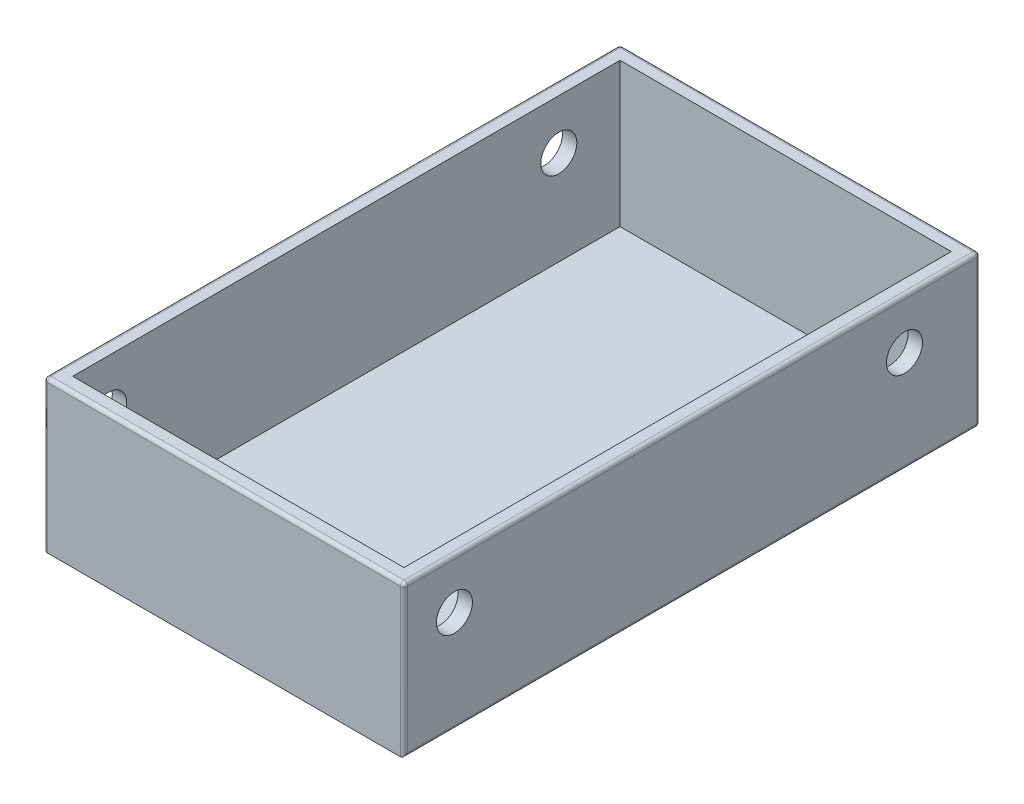
ISO-10303-21;
HEADER;
FILE_DESCRIPTION(('STEP AP214'),'2;1');
FILE_NAME('part.step','',(''),(''),'','','');
FILE_SCHEMA(('AUTOMOTIVE_DESIGN { 1 0 10303 214 1 1 1 1 }'));
ENDSEC;
DATA;
#1=APPLICATION_CONTEXT('core data for automotive mechanical design processes');
#2=APPLICATION_PROTOCOL_DEFINITION('international standard','automotive_design',2000,#1);
#3=PRODUCT_CONTEXT('',#1,'mechanical');
#4=PRODUCT('Part','Part','',(#3));
#5=PRODUCT_RELATED_PRODUCT_CATEGORY('part','',(#4));
#6=PRODUCT_DEFINITION_FORMATION('','',#4);
#7=PRODUCT_DEFINITION_CONTEXT('part definition',#1,'design');
#8=PRODUCT_DEFINITION('design','',#6,#7);
#9=PRODUCT_DEFINITION_SHAPE('','',#8);
#10=(LENGTH_UNIT() NAMED_UNIT(*) SI_UNIT(.MILLI.,.METRE.));
#11=(NAMED_UNIT(*) PLANE_ANGLE_UNIT() SI_UNIT($,.RADIAN.));
#12=(NAMED_UNIT(*) SI_UNIT($,.STERADIAN.) SOLID_ANGLE_UNIT());
#13=UNCERTAINTY_MEASURE_WITH_UNIT(LENGTH_MEASURE(1.E-05),#10,'distance_accuracy_value','');
#14=(GEOMETRIC_REPRESENTATION_CONTEXT(3) GLOBAL_UNCERTAINTY_ASSIGNED_CONTEXT((#13)) GLOBAL_UNIT_ASSIGNED_CONTEXT((#10,
#11,#12)) REPRESENTATION_CONTEXT('',''));
#15=CARTESIAN_POINT('',(0.,0.,0.));
#16=DIRECTION('',(0.,0.,1.));
#17=DIRECTION('',(1.,0.,0.));
#18=AXIS2_PLACEMENT_3D('',#15,#16,#17);
#19=CARTESIAN_POINT('',(0.,-5.,0.));
#20=DIRECTION('',(-1.,0.,0.));
#21=DIRECTION('',(0.,0.,1.));
#22=AXIS2_PLACEMENT_3D('',#19,#20,#21);
#23=PLANE('',#22);
#24=DIRECTION('',(0.,1.,0.));
#25=VECTOR('',#24,1.);
#26=CARTESIAN_POINT('',(0.,-5.,-79.5));
#27=LINE('',#26,#25);
#28=CARTESIAN_POINT('',(0.,14.5,-79.5));
#29=VERTEX_POINT('',#28);
#30=CARTESIAN_POINT('',(0.,-5.5,-79.5));
#31=VERTEX_POINT('',#30);
#32=EDGE_CURVE('E227',#29,#31,#27,.F.);
#33=ORIENTED_EDGE('',*,*,#32,.T.);
#34=DIRECTION('',(0.,0.,-1.));
#35=VECTOR('',#34,1.);
#36=CARTESIAN_POINT('',(0.,-5.5,0.));
#37=LINE('',#36,#35);
#38=CARTESIAN_POINT('',(0.,-5.5,-0.5));
#39=VERTEX_POINT('',#38);
#40=EDGE_CURVE('E232',#31,#39,#37,.F.);
#41=ORIENTED_EDGE('',*,*,#40,.T.);
#42=DIRECTION('',(0.,1.,0.));
#43=VECTOR('',#42,1.);
#44=CARTESIAN_POINT('',(0.,-5.,-0.5));
#45=LINE('',#44,#43);
#46=CARTESIAN_POINT('',(0.,14.5,-0.5));
#47=VERTEX_POINT('',#46);
#48=EDGE_CURVE('E229',#39,#47,#45,.T.);
#49=ORIENTED_EDGE('',*,*,#48,.T.);
#50=DIRECTION('',(0.,0.,1.));
#51=VECTOR('',#50,1.);
#52=CARTESIAN_POINT('',(0.,14.5,-80.));
#53=LINE('',#52,#51);
#54=EDGE_CURVE('E225',#47,#29,#53,.F.);
#55=ORIENTED_EDGE('',*,*,#54,.T.);
#56=EDGE_LOOP('',(#33,#41,#49,#55));
#57=FACE_BOUND('',#56,.T.);
#58=CARTESIAN_POINT('',(0.,8.1,-69.5));
#59=DIRECTION('',(-1.,0.,0.));
#60=DIRECTION('',(0.,0.,1.));
#61=AXIS2_PLACEMENT_3D('',#58,#59,#60);
#62=CIRCLE('',#61,2.5);
#63=CARTESIAN_POINT('',(0.,8.1,-67.));
#64=VERTEX_POINT('',#63);
#65=EDGE_CURVE('E174',#64,#64,#62,.T.);
#66=ORIENTED_EDGE('',*,*,#65,.F.);
#67=EDGE_LOOP('',(#66));
#68=FACE_BOUND('',#67,.T.);
#69=CARTESIAN_POINT('',(0.,8.1,-6.99999999999999));
#70=DIRECTION('',(-1.,0.,0.));
#71=DIRECTION('',(0.,0.,1.));
#72=AXIS2_PLACEMENT_3D('',#69,#70,#71);
#73=CIRCLE('',#72,2.5);
#74=CARTESIAN_POINT('',(0.,8.1,-4.49999999999999));
#75=VERTEX_POINT('',#74);
#76=EDGE_CURVE('E209',#75,#75,#73,.T.);
#77=ORIENTED_EDGE('',*,*,#76,.F.);
#78=EDGE_LOOP('',(#77));
#79=FACE_BOUND('',#78,.T.);
#80=ADVANCED_FACE('F35',(#57,#68,#79),#23,.T.);
#81=CARTESIAN_POINT('',(0.,-5.,-80.));
#82=DIRECTION('',(0.,0.,-1.));
#83=DIRECTION('',(-1.,0.,0.));
#84=AXIS2_PLACEMENT_3D('',#81,#82,#83);
#85=PLANE('',#84);
#86=DIRECTION('',(0.,1.,0.));
#87=VECTOR('',#86,1.);
#88=CARTESIAN_POINT('',(49.5,-5.,-80.));
#89=LINE('',#88,#87);
#90=CARTESIAN_POINT('',(49.5,14.5,-80.));
#91=VERTEX_POINT('',#90);
#92=CARTESIAN_POINT('',(49.5,-5.5,-80.));
#93=VERTEX_POINT('',#92);
#94=EDGE_CURVE('E236',#91,#93,#89,.F.);
#95=ORIENTED_EDGE('',*,*,#94,.T.);
#96=DIRECTION('',(1.,0.,0.));
#97=VECTOR('',#96,1.);
#98=CARTESIAN_POINT('',(0.,-5.5,-80.));
#99=LINE('',#98,#97);
#100=CARTESIAN_POINT('',(0.499999999999993,-5.5,-80.));
#101=VERTEX_POINT('',#100);
#102=EDGE_CURVE('E241',#93,#101,#99,.F.);
#103=ORIENTED_EDGE('',*,*,#102,.T.);
#104=DIRECTION('',(0.,1.,0.));
#105=VECTOR('',#104,1.);
#106=CARTESIAN_POINT('',(0.499999999999993,-5.,-80.));
#107=LINE('',#106,#105);
#108=CARTESIAN_POINT('',(0.499999999999993,14.5,-80.));
#109=VERTEX_POINT('',#108);
#110=EDGE_CURVE('E238',#101,#109,#107,.T.);
#111=ORIENTED_EDGE('',*,*,#110,.T.);
#112=DIRECTION('',(-1.,0.,0.));
#113=VECTOR('',#112,1.);
#114=CARTESIAN_POINT('',(50.,14.5,-80.));
#115=LINE('',#114,#113);
#116=EDGE_CURVE('E234',#109,#91,#115,.F.);
#117=ORIENTED_EDGE('',*,*,#116,.T.);
#118=EDGE_LOOP('',(#95,#103,#111,#117));
#119=FACE_BOUND('',#118,.T.);
#120=ADVANCED_FACE('F339',(#119),#85,.T.);
#121=CARTESIAN_POINT('',(50.,-5.,0.));
#122=DIRECTION('',(1.,0.,0.));
#123=DIRECTION('',(0.,0.,-1.));
#124=AXIS2_PLACEMENT_3D('',#121,#122,#123);
#125=PLANE('',#124);
#126=DIRECTION('',(0.,1.,0.));
#127=VECTOR('',#126,1.);
#128=CARTESIAN_POINT('',(50.,-5.,-0.5));
#129=LINE('',#128,#127);
#130=CARTESIAN_POINT('',(50.,14.5,-0.5));
#131=VERTEX_POINT('',#130);
#132=CARTESIAN_POINT('',(50.,-5.5,-0.5));
#133=VERTEX_POINT('',#132);
#134=EDGE_CURVE('E220',#131,#133,#129,.F.);
#135=ORIENTED_EDGE('',*,*,#134,.T.);
#136=DIRECTION('',(0.,0.,-1.));
#137=VECTOR('',#136,1.);
#138=CARTESIAN_POINT('',(50.,-5.5,-80.));
#139=LINE('',#138,#137);
#140=CARTESIAN_POINT('',(50.,-5.5,-79.5));
#141=VERTEX_POINT('',#140);
#142=EDGE_CURVE('E223',#133,#141,#139,.T.);
#143=ORIENTED_EDGE('',*,*,#142,.T.);
#144=DIRECTION('',(0.,1.,0.));
#145=VECTOR('',#144,1.);
#146=CARTESIAN_POINT('',(50.,-5.,-79.5));
#147=LINE('',#146,#145);
#148=CARTESIAN_POINT('',(50.,14.5,-79.5));
#149=VERTEX_POINT('',#148);
#150=EDGE_CURVE('E218',#141,#149,#147,.T.);
#151=ORIENTED_EDGE('',*,*,#150,.T.);
#152=DIRECTION('',(0.,0.,-1.));
#153=VECTOR('',#152,1.);
#154=CARTESIAN_POINT('',(50.,14.5,0.));
#155=LINE('',#154,#153);
#156=EDGE_CURVE('E216',#149,#131,#155,.F.);
#157=ORIENTED_EDGE('',*,*,#156,.T.);
#158=EDGE_LOOP('',(#135,#143,#151,#157));
#159=FACE_BOUND('',#158,.T.);
#160=CARTESIAN_POINT('',(50.,8.1,-69.5));
#161=DIRECTION('',(1.,0.,0.));
#162=DIRECTION('',(0.,0.,-1.));
#163=AXIS2_PLACEMENT_3D('',#160,#161,#162);
#164=CIRCLE('',#163,2.5);
#165=CARTESIAN_POINT('',(50.,8.1,-72.));
#166=VERTEX_POINT('',#165);
#167=EDGE_CURVE('E204',#166,#166,#164,.T.);
#168=ORIENTED_EDGE('',*,*,#167,.F.);
#169=EDGE_LOOP('',(#168));
#170=FACE_BOUND('',#169,.T.);
#171=CARTESIAN_POINT('',(50.,8.1,-7.));
#172=DIRECTION('',(1.,0.,0.));
#173=DIRECTION('',(0.,0.,-1.));
#174=AXIS2_PLACEMENT_3D('',#171,#172,#173);
#175=CIRCLE('',#174,2.5);
#176=CARTESIAN_POINT('',(50.,8.1,-9.5));
#177=VERTEX_POINT('',#176);
#178=EDGE_CURVE('E314',#177,#177,#175,.T.);
#179=ORIENTED_EDGE('',*,*,#178,.F.);
#180=EDGE_LOOP('',(#179));
#181=FACE_BOUND('',#180,.T.);
#182=ADVANCED_FACE('F366',(#159,#170,#181),#125,.T.);
#183=CARTESIAN_POINT('',(0.,-5.,0.));
#184=DIRECTION('',(0.,0.,1.));
#185=DIRECTION('',(1.,0.,0.));
#186=AXIS2_PLACEMENT_3D('',#183,#184,#185);
#187=PLANE('',#186);
#188=DIRECTION('',(1.,0.,0.));
#189=VECTOR('',#188,1.);
#190=CARTESIAN_POINT('',(0.,-6.,0.));
#191=LINE('',#190,#189);
#192=CARTESIAN_POINT('',(0.5,-6.,0.));
#193=VERTEX_POINT('',#192);
#194=CARTESIAN_POINT('',(49.5,-6.,0.));
#195=VERTEX_POINT('',#194);
#196=EDGE_CURVE('E192',#193,#195,#191,.T.);
#197=ORIENTED_EDGE('',*,*,#196,.T.);
#198=DIRECTION('',(0.,1.,0.));
#199=VECTOR('',#198,1.);
#200=CARTESIAN_POINT('',(49.5,-5.,0.));
#201=LINE('',#200,#199);
#202=CARTESIAN_POINT('',(49.5,14.5,0.));
#203=VERTEX_POINT('',#202);
#204=EDGE_CURVE('E213',#195,#203,#201,.T.);
#205=ORIENTED_EDGE('',*,*,#204,.T.);
#206=DIRECTION('',(1.,0.,0.));
#207=VECTOR('',#206,1.);
#208=CARTESIAN_POINT('',(0.,14.5,0.));
#209=LINE('',#208,#207);
#210=CARTESIAN_POINT('',(0.5,14.5,0.));
#211=VERTEX_POINT('',#210);
#212=EDGE_CURVE('E163',#203,#211,#209,.F.);
#213=ORIENTED_EDGE('',*,*,#212,.T.);
#214=DIRECTION('',(0.,1.,0.));
#215=VECTOR('',#214,1.);
#216=CARTESIAN_POINT('',(0.5,-5.,0.));
#217=LINE('',#216,#215);
#218=EDGE_CURVE('E211',#211,#193,#217,.F.);
#219=ORIENTED_EDGE('',*,*,#218,.T.);
#220=EDGE_LOOP('',(#197,#205,#213,#219));
#221=FACE_BOUND('',#220,.T.);
#222=ADVANCED_FACE('F370',(#221),#187,.T.);
#223=CARTESIAN_POINT('',(0.,-6.,0.));
#224=DIRECTION('',(0.,1.,0.));
#225=DIRECTION('',(0.,0.,1.));
#226=AXIS2_PLACEMENT_3D('',#223,#224,#225);
#227=PLANE('',#226);
#228=ORIENTED_EDGE('',*,*,#196,.F.);
#229=DIRECTION('',(0.,0.,-1.));
#230=VECTOR('',#229,1.);
#231=CARTESIAN_POINT('',(0.499999999999993,-6.,-80.));
#232=LINE('',#231,#230);
#233=CARTESIAN_POINT('',(0.499999999999993,-6.,-79.5));
#234=VERTEX_POINT('',#233);
#235=EDGE_CURVE('E255',#193,#234,#232,.T.);
#236=ORIENTED_EDGE('',*,*,#235,.T.);
#237=DIRECTION('',(1.,0.,0.));
#238=VECTOR('',#237,1.);
#239=CARTESIAN_POINT('',(50.,-6.,-79.5));
#240=LINE('',#239,#238);
#241=CARTESIAN_POINT('',(49.5,-6.,-79.5));
#242=VERTEX_POINT('',#241);
#243=EDGE_CURVE('E251',#234,#242,#240,.T.);
#244=ORIENTED_EDGE('',*,*,#243,.T.);
#245=DIRECTION('',(0.,0.,-1.));
#246=VECTOR('',#245,1.);
#247=CARTESIAN_POINT('',(49.5,-6.,0.));
#248=LINE('',#247,#246);
#249=EDGE_CURVE('E253',#242,#195,#248,.F.);
#250=ORIENTED_EDGE('',*,*,#249,.T.);
#251=EDGE_LOOP('',(#228,#236,#244,#250));
#252=FACE_BOUND('',#251,.T.);
#253=ADVANCED_FACE('F373',(#252),#227,.F.);
#254=CARTESIAN_POINT('',(0.,15.,0.));
#255=DIRECTION('',(0.,-1.,0.));
#256=DIRECTION('',(0.,0.,-1.));
#257=AXIS2_PLACEMENT_3D('',#254,#255,#256);
#258=PLANE('',#257);
#259=DIRECTION('',(0.,0.,1.));
#260=VECTOR('',#259,1.);
#261=CARTESIAN_POINT('',(0.5,15.,0.));
#262=LINE('',#261,#260);
#263=CARTESIAN_POINT('',(0.499999999999993,15.,-79.5));
#264=VERTEX_POINT('',#263);
#265=CARTESIAN_POINT('',(0.5,15.,-0.5));
#266=VERTEX_POINT('',#265);
#267=EDGE_CURVE('E59',#264,#266,#262,.T.);
#268=ORIENTED_EDGE('',*,*,#267,.T.);
#269=DIRECTION('',(1.,0.,0.));
#270=VECTOR('',#269,1.);
#271=CARTESIAN_POINT('',(50.,15.,-0.5));
#272=LINE('',#271,#270);
#273=CARTESIAN_POINT('',(49.5,15.,-0.5));
#274=VERTEX_POINT('',#273);
#275=EDGE_CURVE('E11',#266,#274,#272,.T.);
#276=ORIENTED_EDGE('',*,*,#275,.T.);
#277=DIRECTION('',(0.,0.,-1.));
#278=VECTOR('',#277,1.);
#279=CARTESIAN_POINT('',(49.5,15.,-80.));
#280=LINE('',#279,#278);
#281=CARTESIAN_POINT('',(49.5,15.,-79.5));
#282=VERTEX_POINT('',#281);
#283=EDGE_CURVE('E44',#274,#282,#280,.T.);
#284=ORIENTED_EDGE('',*,*,#283,.T.);
#285=DIRECTION('',(-1.,0.,0.));
#286=VECTOR('',#285,1.);
#287=CARTESIAN_POINT('',(0.,15.,-79.5));
#288=LINE('',#287,#286);
#289=EDGE_CURVE('E257',#282,#264,#288,.T.);
#290=ORIENTED_EDGE('',*,*,#289,.T.);
#291=EDGE_LOOP('',(#268,#276,#284,#290));
#292=FACE_BOUND('',#291,.T.);
#293=DIRECTION('',(0.,0.,1.));
#294=VECTOR('',#293,1.);
#295=CARTESIAN_POINT('',(2.,15.,-2.));
#296=LINE('',#295,#294);
#297=CARTESIAN_POINT('',(2.,15.,-78.));
#298=VERTEX_POINT('',#297);
#299=CARTESIAN_POINT('',(2.,15.,-2.));
#300=VERTEX_POINT('',#299);
#301=EDGE_CURVE('E167',#298,#300,#296,.T.);
#302=ORIENTED_EDGE('',*,*,#301,.F.);
#303=DIRECTION('',(-1.,0.,0.));
#304=VECTOR('',#303,1.);
#305=CARTESIAN_POINT('',(2.,15.,-78.));
#306=LINE('',#305,#304);
#307=CARTESIAN_POINT('',(48.,15.,-78.));
#308=VERTEX_POINT('',#307);
#309=EDGE_CURVE('E180',#308,#298,#306,.T.);
#310=ORIENTED_EDGE('',*,*,#309,.F.);
#311=DIRECTION('',(0.,0.,-1.));
#312=VECTOR('',#311,1.);
#313=CARTESIAN_POINT('',(48.,15.,-2.));
#314=LINE('',#313,#312);
#315=CARTESIAN_POINT('',(48.,15.,-2.));
#316=VERTEX_POINT('',#315);
#317=EDGE_CURVE('E178',#316,#308,#314,.T.);
#318=ORIENTED_EDGE('',*,*,#317,.F.);
#319=DIRECTION('',(1.,0.,0.));
#320=VECTOR('',#319,1.);
#321=CARTESIAN_POINT('',(2.,15.,-2.));
#322=LINE('',#321,#320);
#323=EDGE_CURVE('E157',#300,#316,#322,.T.);
#324=ORIENTED_EDGE('',*,*,#323,.F.);
#325=EDGE_LOOP('',(#302,#310,#318,#324));
#326=FACE_BOUND('',#325,.T.);
#327=ADVANCED_FACE('F176',(#292,#326),#258,.F.);
#328=CARTESIAN_POINT('',(0.,-5.,0.));
#329=DIRECTION('',(0.,1.,0.));
#330=DIRECTION('',(0.,0.,1.));
#331=AXIS2_PLACEMENT_3D('',#328,#329,#330);
#332=PLANE('',#331);
#333=DIRECTION('',(0.,0.,-1.));
#334=VECTOR('',#333,1.);
#335=CARTESIAN_POINT('',(2.,-5.,0.));
#336=LINE('',#335,#334);
#337=CARTESIAN_POINT('',(2.,-5.,-2.5));
#338=VERTEX_POINT('',#337);
#339=CARTESIAN_POINT('',(2.,-5.,-78.));
#340=VERTEX_POINT('',#339);
#341=EDGE_CURVE('E190',#338,#340,#336,.T.);
#342=ORIENTED_EDGE('',*,*,#341,.F.);
#343=DIRECTION('',(1.,0.,0.));
#344=VECTOR('',#343,1.);
#345=CARTESIAN_POINT('',(48.,-5.,-2.5));
#346=LINE('',#345,#344);
#347=CARTESIAN_POINT('',(48.,-5.,-2.5));
#348=VERTEX_POINT('',#347);
#349=EDGE_CURVE('E243',#338,#348,#346,.T.);
#350=ORIENTED_EDGE('',*,*,#349,.T.);
#351=DIRECTION('',(0.,0.,-1.));
#352=VECTOR('',#351,1.);
#353=CARTESIAN_POINT('',(48.,-5.,0.));
#354=LINE('',#353,#352);
#355=CARTESIAN_POINT('',(48.,-5.,-78.));
#356=VERTEX_POINT('',#355);
#357=EDGE_CURVE('E185',#348,#356,#354,.T.);
#358=ORIENTED_EDGE('',*,*,#357,.T.);
#359=DIRECTION('',(1.,0.,0.));
#360=VECTOR('',#359,1.);
#361=CARTESIAN_POINT('',(0.,-5.,-78.));
#362=LINE('',#361,#360);
#363=EDGE_CURVE('E187',#340,#356,#362,.T.);
#364=ORIENTED_EDGE('',*,*,#363,.F.);
#365=EDGE_LOOP('',(#342,#350,#358,#364));
#366=FACE_BOUND('',#365,.T.);
#367=ADVANCED_FACE('F483',(#366),#332,.T.);
#368=CARTESIAN_POINT('',(2.,10.,-2.));
#369=DIRECTION('',(0.,0.,-1.));
#370=DIRECTION('',(-1.,0.,0.));
#371=AXIS2_PLACEMENT_3D('',#368,#369,#370);
#372=PLANE('',#371);
#373=DIRECTION('',(0.,-1.,0.));
#374=VECTOR('',#373,1.);
#375=CARTESIAN_POINT('',(48.,10.,-2.));
#376=LINE('',#375,#374);
#377=CARTESIAN_POINT('',(48.,-4.5,-2.));
#378=VERTEX_POINT('',#377);
#379=EDGE_CURVE('E164',#316,#378,#376,.T.);
#380=ORIENTED_EDGE('',*,*,#379,.T.);
#381=DIRECTION('',(1.,0.,0.));
#382=VECTOR('',#381,1.);
#383=CARTESIAN_POINT('',(2.,-4.5,-2.));
#384=LINE('',#383,#382);
#385=CARTESIAN_POINT('',(2.,-4.5,-2.));
#386=VERTEX_POINT('',#385);
#387=EDGE_CURVE('E160',#378,#386,#384,.F.);
#388=ORIENTED_EDGE('',*,*,#387,.T.);
#389=DIRECTION('',(0.,-1.,0.));
#390=VECTOR('',#389,1.);
#391=CARTESIAN_POINT('',(2.,10.,-2.));
#392=LINE('',#391,#390);
#393=EDGE_CURVE('E152',#300,#386,#392,.T.);
#394=ORIENTED_EDGE('',*,*,#393,.F.);
#395=ORIENTED_EDGE('',*,*,#323,.T.);
#396=EDGE_LOOP('',(#380,#388,#394,#395));
#397=FACE_BOUND('',#396,.T.);
#398=ADVANCED_FACE('F155',(#397),#372,.T.);
#399=CARTESIAN_POINT('',(2.,10.,-78.));
#400=DIRECTION('',(0.,0.,1.));
#401=DIRECTION('',(1.,0.,0.));
#402=AXIS2_PLACEMENT_3D('',#399,#400,#401);
#403=PLANE('',#402);
#404=ORIENTED_EDGE('',*,*,#363,.T.);
#405=DIRECTION('',(0.,-1.,0.));
#406=VECTOR('',#405,1.);
#407=CARTESIAN_POINT('',(48.,10.,-78.));
#408=LINE('',#407,#406);
#409=EDGE_CURVE('E196',#308,#356,#408,.T.);
#410=ORIENTED_EDGE('',*,*,#409,.F.);
#411=ORIENTED_EDGE('',*,*,#309,.T.);
#412=DIRECTION('',(0.,-1.,0.));
#413=VECTOR('',#412,1.);
#414=CARTESIAN_POINT('',(2.,10.,-78.));
#415=LINE('',#414,#413);
#416=EDGE_CURVE('E170',#298,#340,#415,.T.);
#417=ORIENTED_EDGE('',*,*,#416,.T.);
#418=EDGE_LOOP('',(#404,#410,#411,#417));
#419=FACE_BOUND('',#418,.T.);
#420=ADVANCED_FACE('F358',(#419),#403,.T.);
#421=CARTESIAN_POINT('',(48.,10.,-2.));
#422=DIRECTION('',(-1.,0.,0.));
#423=DIRECTION('',(0.,0.,1.));
#424=AXIS2_PLACEMENT_3D('',#421,#422,#423);
#425=PLANE('',#424);
#426=CARTESIAN_POINT('',(48.,8.1,-69.5));
#427=DIRECTION('',(-1.,0.,0.));
#428=DIRECTION('',(0.,0.,1.));
#429=AXIS2_PLACEMENT_3D('',#426,#427,#428);
#430=CIRCLE('',#429,2.5);
#431=CARTESIAN_POINT('',(48.,8.1,-67.));
#432=VERTEX_POINT('',#431);
#433=EDGE_CURVE('E208',#432,#432,#430,.T.);
#434=ORIENTED_EDGE('',*,*,#433,.F.);
#435=EDGE_LOOP('',(#434));
#436=FACE_BOUND('',#435,.T.);
#437=CARTESIAN_POINT('',(48.,8.1,-7.));
#438=DIRECTION('',(-1.,0.,0.));
#439=DIRECTION('',(0.,0.,1.));
#440=AXIS2_PLACEMENT_3D('',#437,#438,#439);
#441=CIRCLE('',#440,2.5);
#442=CARTESIAN_POINT('',(48.,8.1,-4.5));
#443=VERTEX_POINT('',#442);
#444=EDGE_CURVE('E203',#443,#443,#441,.T.);
#445=ORIENTED_EDGE('',*,*,#444,.F.);
#446=EDGE_LOOP('',(#445));
#447=FACE_BOUND('',#446,.T.);
#448=ORIENTED_EDGE('',*,*,#357,.F.);
#449=CARTESIAN_POINT('',(48.,-4.5,-2.5));
#450=DIRECTION('',(-1.,0.,0.));
#451=DIRECTION('',(0.,0.,1.));
#452=AXIS2_PLACEMENT_3D('',#449,#450,#451);
#453=CIRCLE('',#452,0.5);
#454=EDGE_CURVE('E246',#348,#378,#453,.T.);
#455=ORIENTED_EDGE('',*,*,#454,.T.);
#456=ORIENTED_EDGE('',*,*,#379,.F.);
#457=ORIENTED_EDGE('',*,*,#317,.T.);
#458=ORIENTED_EDGE('',*,*,#409,.T.);
#459=EDGE_LOOP('',(#448,#455,#456,#457,#458));
#460=FACE_BOUND('',#459,.T.);
#461=ADVANCED_FACE('F352',(#436,#447,#460),#425,.T.);
#462=CARTESIAN_POINT('',(2.,10.,-2.));
#463=DIRECTION('',(1.,0.,0.));
#464=DIRECTION('',(0.,0.,-1.));
#465=AXIS2_PLACEMENT_3D('',#462,#463,#464);
#466=PLANE('',#465);
#467=CARTESIAN_POINT('',(2.,8.1,-69.5));
#468=DIRECTION('',(1.,0.,0.));
#469=DIRECTION('',(0.,0.,-1.));
#470=AXIS2_PLACEMENT_3D('',#467,#468,#469);
#471=CIRCLE('',#470,2.5);
#472=CARTESIAN_POINT('',(2.,8.1,-72.));
#473=VERTEX_POINT('',#472);
#474=EDGE_CURVE('E205',#473,#473,#471,.T.);
#475=ORIENTED_EDGE('',*,*,#474,.F.);
#476=EDGE_LOOP('',(#475));
#477=FACE_BOUND('',#476,.T.);
#478=CARTESIAN_POINT('',(2.,8.1,-6.99999999999999));
#479=DIRECTION('',(1.,0.,0.));
#480=DIRECTION('',(0.,0.,-1.));
#481=AXIS2_PLACEMENT_3D('',#478,#479,#480);
#482=CIRCLE('',#481,2.5);
#483=CARTESIAN_POINT('',(2.,8.1,-9.49999999999999));
#484=VERTEX_POINT('',#483);
#485=EDGE_CURVE('E200',#484,#484,#482,.T.);
#486=ORIENTED_EDGE('',*,*,#485,.F.);
#487=EDGE_LOOP('',(#486));
#488=FACE_BOUND('',#487,.T.);
#489=ORIENTED_EDGE('',*,*,#393,.T.);
#490=CARTESIAN_POINT('',(2.,-4.5,-2.5));
#491=DIRECTION('',(1.,0.,0.));
#492=DIRECTION('',(0.,0.,-1.));
#493=AXIS2_PLACEMENT_3D('',#490,#491,#492);
#494=CIRCLE('',#493,0.5);
#495=EDGE_CURVE('E249',#386,#338,#494,.T.);
#496=ORIENTED_EDGE('',*,*,#495,.T.);
#497=ORIENTED_EDGE('',*,*,#341,.T.);
#498=ORIENTED_EDGE('',*,*,#416,.F.);
#499=ORIENTED_EDGE('',*,*,#301,.T.);
#500=EDGE_LOOP('',(#489,#496,#497,#498,#499));
#501=FACE_BOUND('',#500,.T.);
#502=ADVANCED_FACE('F168',(#477,#488,#501),#466,.T.);
#503=CARTESIAN_POINT('',(-11.,8.1,-6.99999999999999));
#504=DIRECTION('',(1.,0.,0.));
#505=DIRECTION('',(0.,0.,-1.));
#506=AXIS2_PLACEMENT_3D('',#503,#504,#505);
#507=CYLINDRICAL_SURFACE('',#506,2.5);
#508=ORIENTED_EDGE('',*,*,#76,.T.);
#509=EDGE_LOOP('',(#508));
#510=FACE_BOUND('',#509,.T.);
#511=ORIENTED_EDGE('',*,*,#485,.T.);
#512=EDGE_LOOP('',(#511));
#513=FACE_BOUND('',#512,.T.);
#514=ADVANCED_FACE('F344',(#510,#513),#507,.F.);
#515=CARTESIAN_POINT('',(-11.,8.1,-69.5));
#516=DIRECTION('',(1.,0.,0.));
#517=DIRECTION('',(0.,0.,-1.));
#518=AXIS2_PLACEMENT_3D('',#515,#516,#517);
#519=CYLINDRICAL_SURFACE('',#518,2.5);
#520=ORIENTED_EDGE('',*,*,#65,.T.);
#521=EDGE_LOOP('',(#520));
#522=FACE_BOUND('',#521,.T.);
#523=ORIENTED_EDGE('',*,*,#474,.T.);
#524=EDGE_LOOP('',(#523));
#525=FACE_BOUND('',#524,.T.);
#526=ADVANCED_FACE('F334',(#522,#525),#519,.F.);
#527=ORIENTED_EDGE('',*,*,#444,.T.);
#528=EDGE_LOOP('',(#527));
#529=FACE_BOUND('',#528,.T.);
#530=ORIENTED_EDGE('',*,*,#178,.T.);
#531=EDGE_LOOP('',(#530));
#532=FACE_BOUND('',#531,.T.);
#533=ADVANCED_FACE('F348',(#529,#532),#507,.F.);
#534=ORIENTED_EDGE('',*,*,#433,.T.);
#535=EDGE_LOOP('',(#534));
#536=FACE_BOUND('',#535,.T.);
#537=ORIENTED_EDGE('',*,*,#167,.T.);
#538=EDGE_LOOP('',(#537));
#539=FACE_BOUND('',#538,.T.);
#540=ADVANCED_FACE('F438',(#536,#539),#519,.F.);
#541=CARTESIAN_POINT('',(0.499999999999993,-5.,-79.5));
#542=DIRECTION('',(0.,1.,0.));
#543=DIRECTION('',(0.,0.,1.));
#544=AXIS2_PLACEMENT_3D('',#541,#542,#543);
#545=CYLINDRICAL_SURFACE('',#544,0.5);
#546=CARTESIAN_POINT('',(0.499999999999993,-5.5,-79.5));
#547=DIRECTION('',(0.,-1.,0.));
#548=DIRECTION('',(0.,0.,-1.));
#549=AXIS2_PLACEMENT_3D('',#546,#547,#548);
#550=CIRCLE('',#549,0.5);
#551=EDGE_CURVE('E308',#31,#101,#550,.T.);
#552=ORIENTED_EDGE('',*,*,#551,.F.);
#553=ORIENTED_EDGE('',*,*,#32,.F.);
#554=CARTESIAN_POINT('',(0.499999999999993,14.5,-79.5));
#555=DIRECTION('',(0.,1.,0.));
#556=DIRECTION('',(0.,0.,1.));
#557=AXIS2_PLACEMENT_3D('',#554,#555,#556);
#558=CIRCLE('',#557,0.5);
#559=EDGE_CURVE('E39',#109,#29,#558,.T.);
#560=ORIENTED_EDGE('',*,*,#559,.F.);
#561=ORIENTED_EDGE('',*,*,#110,.F.);
#562=EDGE_LOOP('',(#552,#553,#560,#561));
#563=FACE_BOUND('',#562,.T.);
#564=ADVANCED_FACE('F435',(#563),#545,.T.);
#565=CARTESIAN_POINT('',(0.5,-5.5,0.));
#566=DIRECTION('',(0.,0.,1.));
#567=DIRECTION('',(1.,0.,0.));
#568=AXIS2_PLACEMENT_3D('',#565,#566,#567);
#569=CYLINDRICAL_SURFACE('',#568,0.5);
#570=CARTESIAN_POINT('',(0.5,-5.5,-0.5));
#571=DIRECTION('',(0.,0.707106781186547,0.707106781186547));
#572=DIRECTION('',(0.,-0.707106781186547,0.707106781186547));
#573=AXIS2_PLACEMENT_3D('',#570,#571,#572);
#574=ELLIPSE('',#573,0.707106781186547,0.5);
#575=EDGE_CURVE('E303',#39,#193,#574,.T.);
#576=ORIENTED_EDGE('',*,*,#575,.F.);
#577=ORIENTED_EDGE('',*,*,#40,.F.);
#578=CARTESIAN_POINT('',(0.499999999999993,-5.5,-79.5));
#579=DIRECTION('',(0.,0.,-1.));
#580=DIRECTION('',(-1.,0.,0.));
#581=AXIS2_PLACEMENT_3D('',#578,#579,#580);
#582=CIRCLE('',#581,0.5);
#583=EDGE_CURVE('E306',#234,#31,#582,.T.);
#584=ORIENTED_EDGE('',*,*,#583,.F.);
#585=ORIENTED_EDGE('',*,*,#235,.F.);
#586=EDGE_LOOP('',(#576,#577,#584,#585));
#587=FACE_BOUND('',#586,.T.);
#588=ADVANCED_FACE('F433',(#587),#569,.T.);
#589=CARTESIAN_POINT('',(0.499999999999993,14.5,-79.5));
#590=DIRECTION('',(0.,0.,1.));
#591=DIRECTION('',(1.,0.,0.));
#592=AXIS2_PLACEMENT_3D('',#589,#590,#591);
#593=SPHERICAL_SURFACE('',#592,0.5);
#594=CARTESIAN_POINT('',(0.499999999999993,14.5,-79.5));
#595=DIRECTION('',(-1.,0.,0.));
#596=DIRECTION('',(0.,0.,1.));
#597=AXIS2_PLACEMENT_3D('',#594,#595,#596);
#598=CIRCLE('',#597,0.5);
#599=EDGE_CURVE('E297',#109,#264,#598,.F.);
#600=ORIENTED_EDGE('',*,*,#599,.F.);
#601=ORIENTED_EDGE('',*,*,#559,.T.);
#602=CARTESIAN_POINT('',(0.499999999999993,14.5,-79.5));
#603=DIRECTION('',(0.,0.,-1.));
#604=DIRECTION('',(-1.,0.,0.));
#605=AXIS2_PLACEMENT_3D('',#602,#603,#604);
#606=CIRCLE('',#605,0.5);
#607=EDGE_CURVE('E300',#264,#29,#606,.F.);
#608=ORIENTED_EDGE('',*,*,#607,.F.);
#609=EDGE_LOOP('',(#600,#601,#608));
#610=FACE_BOUND('',#609,.T.);
#611=ADVANCED_FACE('F430',(#610),#593,.T.);
#612=CARTESIAN_POINT('',(0.499999999999993,-5.5,-79.5));
#613=DIRECTION('',(0.,0.,1.));
#614=DIRECTION('',(1.,0.,0.));
#615=AXIS2_PLACEMENT_3D('',#612,#613,#614);
#616=SPHERICAL_SURFACE('',#615,0.5);
#617=ORIENTED_EDGE('',*,*,#583,.T.);
#618=ORIENTED_EDGE('',*,*,#551,.T.);
#619=CARTESIAN_POINT('',(0.499999999999993,-5.5,-79.5));
#620=DIRECTION('',(-1.,0.,0.));
#621=DIRECTION('',(0.,0.,1.));
#622=AXIS2_PLACEMENT_3D('',#619,#620,#621);
#623=CIRCLE('',#622,0.5);
#624=EDGE_CURVE('E294',#234,#101,#623,.F.);
#625=ORIENTED_EDGE('',*,*,#624,.F.);
#626=EDGE_LOOP('',(#617,#618,#625));
#627=FACE_BOUND('',#626,.T.);
#628=ADVANCED_FACE('F426',(#627),#616,.T.);
#629=CARTESIAN_POINT('',(0.5,-5.,-0.5));
#630=DIRECTION('',(0.,1.,0.));
#631=DIRECTION('',(0.,0.,1.));
#632=AXIS2_PLACEMENT_3D('',#629,#630,#631);
#633=CYLINDRICAL_SURFACE('',#632,0.5);
#634=ORIENTED_EDGE('',*,*,#575,.T.);
#635=ORIENTED_EDGE('',*,*,#218,.F.);
#636=CARTESIAN_POINT('',(0.5,14.5,-0.5));
#637=DIRECTION('',(0.,1.,0.));
#638=DIRECTION('',(0.,0.,1.));
#639=AXIS2_PLACEMENT_3D('',#636,#637,#638);
#640=CIRCLE('',#639,0.5);
#641=EDGE_CURVE('E291',#47,#211,#640,.T.);
#642=ORIENTED_EDGE('',*,*,#641,.F.);
#643=ORIENTED_EDGE('',*,*,#48,.F.);
#644=EDGE_LOOP('',(#634,#635,#642,#643));
#645=FACE_BOUND('',#644,.T.);
#646=ADVANCED_FACE('F422',(#645),#633,.T.);
#647=CARTESIAN_POINT('',(0.5,14.5,0.));
#648=DIRECTION('',(0.,0.,-1.));
#649=DIRECTION('',(-1.,0.,0.));
#650=AXIS2_PLACEMENT_3D('',#647,#648,#649);
#651=CYLINDRICAL_SURFACE('',#650,0.5);
#652=ORIENTED_EDGE('',*,*,#607,.T.);
#653=ORIENTED_EDGE('',*,*,#54,.F.);
#654=CARTESIAN_POINT('',(0.5,14.5,-0.5));
#655=DIRECTION('',(0.,0.,1.));
#656=DIRECTION('',(1.,0.,0.));
#657=AXIS2_PLACEMENT_3D('',#654,#655,#656);
#658=CIRCLE('',#657,0.5);
#659=EDGE_CURVE('E289',#266,#47,#658,.T.);
#660=ORIENTED_EDGE('',*,*,#659,.F.);
#661=ORIENTED_EDGE('',*,*,#267,.F.);
#662=EDGE_LOOP('',(#652,#653,#660,#661));
#663=FACE_BOUND('',#662,.T.);
#664=ADVANCED_FACE('F418',(#663),#651,.T.);
#665=CARTESIAN_POINT('',(0.,14.5,-79.5));
#666=DIRECTION('',(1.,0.,0.));
#667=DIRECTION('',(0.,0.,-1.));
#668=AXIS2_PLACEMENT_3D('',#665,#666,#667);
#669=CYLINDRICAL_SURFACE('',#668,0.5);
#670=ORIENTED_EDGE('',*,*,#599,.T.);
#671=ORIENTED_EDGE('',*,*,#289,.F.);
#672=CARTESIAN_POINT('',(49.5,14.5,-79.5));
#673=DIRECTION('',(1.,0.,0.));
#674=DIRECTION('',(0.,0.,-1.));
#675=AXIS2_PLACEMENT_3D('',#672,#673,#674);
#676=CIRCLE('',#675,0.5);
#677=EDGE_CURVE('E286',#91,#282,#676,.T.);
#678=ORIENTED_EDGE('',*,*,#677,.F.);
#679=ORIENTED_EDGE('',*,*,#116,.F.);
#680=EDGE_LOOP('',(#670,#671,#678,#679));
#681=FACE_BOUND('',#680,.T.);
#682=ADVANCED_FACE('F414',(#681),#669,.T.);
#683=CARTESIAN_POINT('',(49.5,-5.,-79.5));
#684=DIRECTION('',(0.,1.,0.));
#685=DIRECTION('',(0.,0.,1.));
#686=AXIS2_PLACEMENT_3D('',#683,#684,#685);
#687=CYLINDRICAL_SURFACE('',#686,0.5);
#688=CARTESIAN_POINT('',(49.5,-5.5,-79.5));
#689=DIRECTION('',(0.,-1.,0.));
#690=DIRECTION('',(0.,0.,-1.));
#691=AXIS2_PLACEMENT_3D('',#688,#689,#690);
#692=CIRCLE('',#691,0.5);
#693=EDGE_CURVE('E280',#93,#141,#692,.T.);
#694=ORIENTED_EDGE('',*,*,#693,.F.);
#695=ORIENTED_EDGE('',*,*,#94,.F.);
#696=CARTESIAN_POINT('',(49.5,14.5,-79.5));
#697=DIRECTION('',(0.,1.,0.));
#698=DIRECTION('',(0.,0.,1.));
#699=AXIS2_PLACEMENT_3D('',#696,#697,#698);
#700=CIRCLE('',#699,0.5);
#701=EDGE_CURVE('E283',#149,#91,#700,.T.);
#702=ORIENTED_EDGE('',*,*,#701,.F.);
#703=ORIENTED_EDGE('',*,*,#150,.F.);
#704=EDGE_LOOP('',(#694,#695,#702,#703));
#705=FACE_BOUND('',#704,.T.);
#706=ADVANCED_FACE('F410',(#705),#687,.T.);
#707=CARTESIAN_POINT('',(0.,-5.5,-79.5));
#708=DIRECTION('',(-1.,0.,0.));
#709=DIRECTION('',(0.,0.,1.));
#710=AXIS2_PLACEMENT_3D('',#707,#708,#709);
#711=CYLINDRICAL_SURFACE('',#710,0.5);
#712=ORIENTED_EDGE('',*,*,#624,.T.);
#713=ORIENTED_EDGE('',*,*,#102,.F.);
#714=CARTESIAN_POINT('',(49.5,-5.5,-79.5));
#715=DIRECTION('',(1.,0.,0.));
#716=DIRECTION('',(0.,0.,-1.));
#717=AXIS2_PLACEMENT_3D('',#714,#715,#716);
#718=CIRCLE('',#717,0.5);
#719=EDGE_CURVE('E277',#242,#93,#718,.T.);
#720=ORIENTED_EDGE('',*,*,#719,.F.);
#721=ORIENTED_EDGE('',*,*,#243,.F.);
#722=EDGE_LOOP('',(#712,#713,#720,#721));
#723=FACE_BOUND('',#722,.T.);
#724=ADVANCED_FACE('F406',(#723),#711,.T.);
#725=CARTESIAN_POINT('',(0.5,14.5,-0.5));
#726=DIRECTION('',(0.,0.,1.));
#727=DIRECTION('',(1.,0.,0.));
#728=AXIS2_PLACEMENT_3D('',#725,#726,#727);
#729=SPHERICAL_SURFACE('',#728,0.5);
#730=ORIENTED_EDGE('',*,*,#659,.T.);
#731=ORIENTED_EDGE('',*,*,#641,.T.);
#732=CARTESIAN_POINT('',(0.5,14.5,-0.5));
#733=DIRECTION('',(-1.,0.,0.));
#734=DIRECTION('',(0.,0.,1.));
#735=AXIS2_PLACEMENT_3D('',#732,#733,#734);
#736=CIRCLE('',#735,0.5);
#737=EDGE_CURVE('E274',#266,#211,#736,.F.);
#738=ORIENTED_EDGE('',*,*,#737,.F.);
#739=EDGE_LOOP('',(#730,#731,#738));
#740=FACE_BOUND('',#739,.T.);
#741=ADVANCED_FACE('F402',(#740),#729,.T.);
#742=CARTESIAN_POINT('',(49.5,14.5,-79.5));
#743=DIRECTION('',(0.,0.,1.));
#744=DIRECTION('',(1.,0.,0.));
#745=AXIS2_PLACEMENT_3D('',#742,#743,#744);
#746=SPHERICAL_SURFACE('',#745,0.5);
#747=ORIENTED_EDGE('',*,*,#701,.T.);
#748=ORIENTED_EDGE('',*,*,#677,.T.);
#749=CARTESIAN_POINT('',(49.5,14.5,-79.5));
#750=DIRECTION('',(0.,0.,-1.));
#751=DIRECTION('',(-1.,0.,0.));
#752=AXIS2_PLACEMENT_3D('',#749,#750,#751);
#753=CIRCLE('',#752,0.5);
#754=EDGE_CURVE('E271',#149,#282,#753,.F.);
#755=ORIENTED_EDGE('',*,*,#754,.F.);
#756=EDGE_LOOP('',(#747,#748,#755));
#757=FACE_BOUND('',#756,.T.);
#758=ADVANCED_FACE('F398',(#757),#746,.T.);
#759=CARTESIAN_POINT('',(49.5,-5.5,-79.5));
#760=DIRECTION('',(0.,0.,1.));
#761=DIRECTION('',(1.,0.,0.));
#762=AXIS2_PLACEMENT_3D('',#759,#760,#761);
#763=SPHERICAL_SURFACE('',#762,0.5);
#764=ORIENTED_EDGE('',*,*,#719,.T.);
#765=ORIENTED_EDGE('',*,*,#693,.T.);
#766=CARTESIAN_POINT('',(49.5,-5.5,-79.5));
#767=DIRECTION('',(0.,0.,-1.));
#768=DIRECTION('',(-1.,0.,0.));
#769=AXIS2_PLACEMENT_3D('',#766,#767,#768);
#770=CIRCLE('',#769,0.5);
#771=EDGE_CURVE('E268',#242,#141,#770,.F.);
#772=ORIENTED_EDGE('',*,*,#771,.F.);
#773=EDGE_LOOP('',(#764,#765,#772));
#774=FACE_BOUND('',#773,.T.);
#775=ADVANCED_FACE('F394',(#774),#763,.T.);
#776=CARTESIAN_POINT('',(0.,14.5,-0.5));
#777=DIRECTION('',(-1.,0.,0.));
#778=DIRECTION('',(0.,0.,1.));
#779=AXIS2_PLACEMENT_3D('',#776,#777,#778);
#780=CYLINDRICAL_SURFACE('',#779,0.5);
#781=ORIENTED_EDGE('',*,*,#737,.T.);
#782=ORIENTED_EDGE('',*,*,#212,.F.);
#783=CARTESIAN_POINT('',(49.5,14.5,-0.5));
#784=DIRECTION('',(1.,0.,0.));
#785=DIRECTION('',(0.,0.,-1.));
#786=AXIS2_PLACEMENT_3D('',#783,#784,#785);
#787=CIRCLE('',#786,0.5);
#788=EDGE_CURVE('E266',#274,#203,#787,.T.);
#789=ORIENTED_EDGE('',*,*,#788,.F.);
#790=ORIENTED_EDGE('',*,*,#275,.F.);
#791=EDGE_LOOP('',(#781,#782,#789,#790));
#792=FACE_BOUND('',#791,.T.);
#793=ADVANCED_FACE('F390',(#792),#780,.T.);
#794=CARTESIAN_POINT('',(49.5,14.5,0.));
#795=DIRECTION('',(0.,0.,1.));
#796=DIRECTION('',(1.,0.,0.));
#797=AXIS2_PLACEMENT_3D('',#794,#795,#796);
#798=CYLINDRICAL_SURFACE('',#797,0.5);
#799=ORIENTED_EDGE('',*,*,#754,.T.);
#800=ORIENTED_EDGE('',*,*,#283,.F.);
#801=CARTESIAN_POINT('',(49.5,14.5,-0.5));
#802=DIRECTION('',(0.,0.,1.));
#803=DIRECTION('',(1.,0.,0.));
#804=AXIS2_PLACEMENT_3D('',#801,#802,#803);
#805=CIRCLE('',#804,0.5);
#806=EDGE_CURVE('E52',#131,#274,#805,.T.);
#807=ORIENTED_EDGE('',*,*,#806,.F.);
#808=ORIENTED_EDGE('',*,*,#156,.F.);
#809=EDGE_LOOP('',(#799,#800,#807,#808));
#810=FACE_BOUND('',#809,.T.);
#811=ADVANCED_FACE('F386',(#810),#798,.T.);
#812=CARTESIAN_POINT('',(49.5,-5.5,0.));
#813=DIRECTION('',(0.,0.,1.));
#814=DIRECTION('',(1.,0.,0.));
#815=AXIS2_PLACEMENT_3D('',#812,#813,#814);
#816=CYLINDRICAL_SURFACE('',#815,0.5);
#817=ORIENTED_EDGE('',*,*,#771,.T.);
#818=ORIENTED_EDGE('',*,*,#142,.F.);
#819=CARTESIAN_POINT('',(49.5,-5.5,-0.5));
#820=DIRECTION('',(0.,0.707106781186547,0.707106781186547));
#821=DIRECTION('',(0.,-0.707106781186547,0.707106781186547));
#822=AXIS2_PLACEMENT_3D('',#819,#820,#821);
#823=ELLIPSE('',#822,0.707106781186547,0.5);
#824=EDGE_CURVE('E263',#195,#133,#823,.T.);
#825=ORIENTED_EDGE('',*,*,#824,.F.);
#826=ORIENTED_EDGE('',*,*,#249,.F.);
#827=EDGE_LOOP('',(#817,#818,#825,#826));
#828=FACE_BOUND('',#827,.T.);
#829=ADVANCED_FACE('F383',(#828),#816,.T.);
#830=CARTESIAN_POINT('',(49.5,14.5,-0.5));
#831=DIRECTION('',(0.,0.,1.));
#832=DIRECTION('',(1.,0.,0.));
#833=AXIS2_PLACEMENT_3D('',#830,#831,#832);
#834=SPHERICAL_SURFACE('',#833,0.5);
#835=ORIENTED_EDGE('',*,*,#806,.T.);
#836=ORIENTED_EDGE('',*,*,#788,.T.);
#837=CARTESIAN_POINT('',(49.5,14.5,-0.5));
#838=DIRECTION('',(0.,1.,0.));
#839=DIRECTION('',(0.,0.,1.));
#840=AXIS2_PLACEMENT_3D('',#837,#838,#839);
#841=CIRCLE('',#840,0.5);
#842=EDGE_CURVE('E261',#131,#203,#841,.F.);
#843=ORIENTED_EDGE('',*,*,#842,.F.);
#844=EDGE_LOOP('',(#835,#836,#843));
#845=FACE_BOUND('',#844,.T.);
#846=ADVANCED_FACE('F379',(#845),#834,.T.);
#847=CARTESIAN_POINT('',(49.5,-5.,-0.5));
#848=DIRECTION('',(0.,1.,0.));
#849=DIRECTION('',(0.,0.,1.));
#850=AXIS2_PLACEMENT_3D('',#847,#848,#849);
#851=CYLINDRICAL_SURFACE('',#850,0.5);
#852=ORIENTED_EDGE('',*,*,#824,.T.);
#853=ORIENTED_EDGE('',*,*,#134,.F.);
#854=ORIENTED_EDGE('',*,*,#842,.T.);
#855=ORIENTED_EDGE('',*,*,#204,.F.);
#856=EDGE_LOOP('',(#852,#853,#854,#855));
#857=FACE_BOUND('',#856,.T.);
#858=ADVANCED_FACE('F376',(#857),#851,.T.);
#859=CARTESIAN_POINT('',(0.,-4.5,-2.5));
#860=DIRECTION('',(-1.,0.,0.));
#861=DIRECTION('',(0.,0.,1.));
#862=AXIS2_PLACEMENT_3D('',#859,#860,#861);
#863=CYLINDRICAL_SURFACE('',#862,0.5);
#864=ORIENTED_EDGE('',*,*,#495,.F.);
#865=ORIENTED_EDGE('',*,*,#387,.F.);
#866=ORIENTED_EDGE('',*,*,#454,.F.);
#867=ORIENTED_EDGE('',*,*,#349,.F.);
#868=EDGE_LOOP('',(#864,#865,#866,#867));
#869=FACE_BOUND('',#868,.T.);
#870=ADVANCED_FACE('F37',(#869),#863,.F.);
#871=CLOSED_SHELL('',(#80,#120,#182,#222,#253,#327,#367,#398,#420,#461,#502,#514,#526,#533,#540,
#564,#588,#611,#628,#646,#664,#682,#706,#724,#741,#758,#775,#793,#811,#829,#846,#858,#870));
#872=MANIFOLD_SOLID_BREP('B2',#871);
#873=ADVANCED_BREP_SHAPE_REPRESENTATION('',(#18,#872),#14);
#874=SHAPE_DEFINITION_REPRESENTATION(#9,#873);
ENDSEC;
END-ISO-10303-21;
